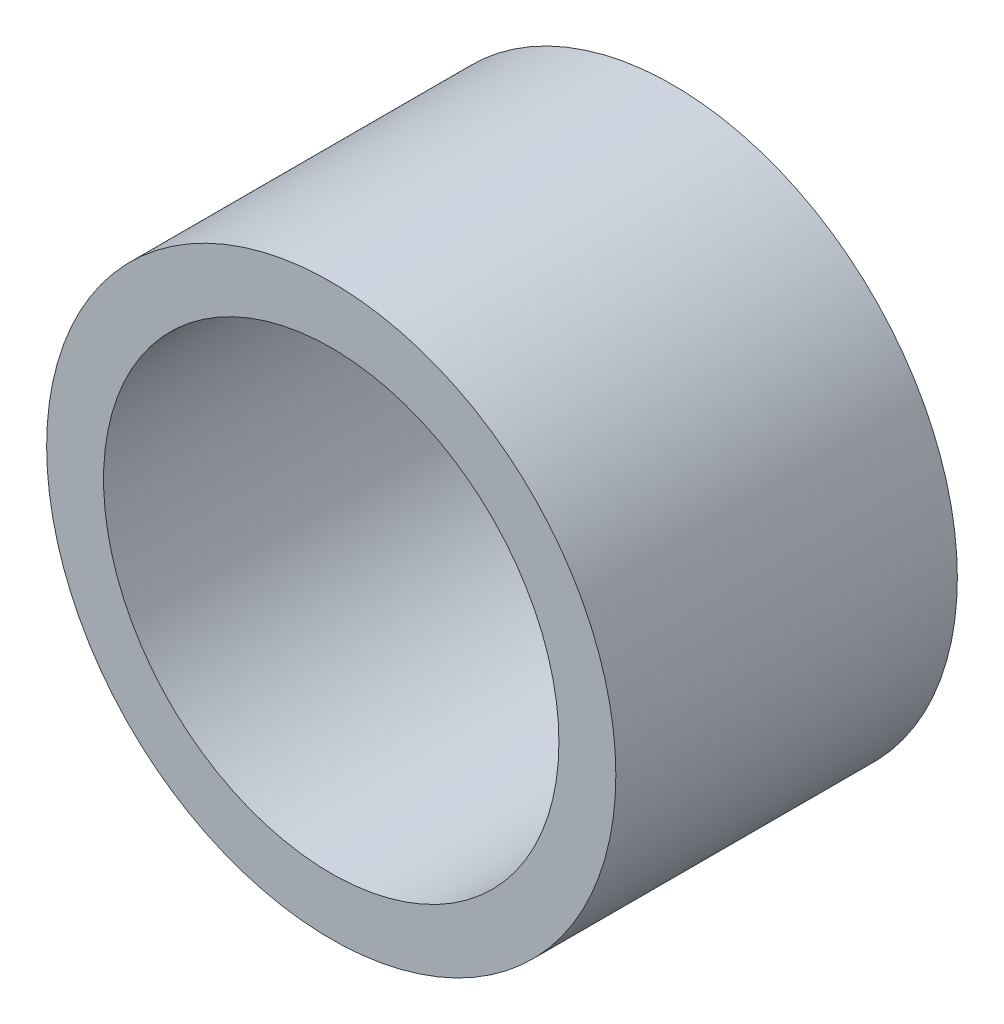
ISO-10303-21;
HEADER;
FILE_DESCRIPTION(('STEP AP214'),'2;1');
FILE_NAME('part.step','',(''),(''),'','','');
FILE_SCHEMA(('AUTOMOTIVE_DESIGN { 1 0 10303 214 1 1 1 1 }'));
ENDSEC;
DATA;
#1=APPLICATION_CONTEXT('core data for automotive mechanical design processes');
#2=APPLICATION_PROTOCOL_DEFINITION('international standard','automotive_design',2000,#1);
#3=PRODUCT_CONTEXT('',#1,'mechanical');
#4=PRODUCT('Part','Part','',(#3));
#5=PRODUCT_RELATED_PRODUCT_CATEGORY('part','',(#4));
#6=PRODUCT_DEFINITION_FORMATION('','',#4);
#7=PRODUCT_DEFINITION_CONTEXT('part definition',#1,'design');
#8=PRODUCT_DEFINITION('design','',#6,#7);
#9=PRODUCT_DEFINITION_SHAPE('','',#8);
#10=(LENGTH_UNIT() NAMED_UNIT(*) SI_UNIT(.MILLI.,.METRE.));
#11=(NAMED_UNIT(*) PLANE_ANGLE_UNIT() SI_UNIT($,.RADIAN.));
#12=(NAMED_UNIT(*) SI_UNIT($,.STERADIAN.) SOLID_ANGLE_UNIT());
#13=UNCERTAINTY_MEASURE_WITH_UNIT(LENGTH_MEASURE(1.E-05),#10,'distance_accuracy_value','');
#14=(GEOMETRIC_REPRESENTATION_CONTEXT(3) GLOBAL_UNCERTAINTY_ASSIGNED_CONTEXT((#13)) GLOBAL_UNIT_ASSIGNED_CONTEXT((#10,
#11,#12)) REPRESENTATION_CONTEXT('',''));
#15=CARTESIAN_POINT('',(0.,0.,0.));
#16=DIRECTION('',(0.,0.,1.));
#17=DIRECTION('',(1.,0.,0.));
#18=AXIS2_PLACEMENT_3D('',#15,#16,#17);
#19=CARTESIAN_POINT('',(0.,0.,4.7625));
#20=DIRECTION('',(0.,0.,1.));
#21=DIRECTION('',(1.,0.,0.));
#22=AXIS2_PLACEMENT_3D('',#19,#20,#21);
#23=PLANE('',#22);
#24=CARTESIAN_POINT('',(0.,0.,4.7625));
#25=DIRECTION('',(0.,0.,1.));
#26=DIRECTION('',(1.,0.,0.));
#27=AXIS2_PLACEMENT_3D('',#24,#25,#26);
#28=CIRCLE('',#27,7.9375);
#29=CARTESIAN_POINT('',(7.9375,0.,4.7625));
#30=VERTEX_POINT('',#29);
#31=EDGE_CURVE('E10',#30,#30,#28,.T.);
#32=ORIENTED_EDGE('',*,*,#31,.T.);
#33=EDGE_LOOP('',(#32));
#34=FACE_BOUND('',#33,.T.);
#35=CARTESIAN_POINT('',(0.,0.,4.7625));
#36=DIRECTION('',(0.,0.,1.));
#37=DIRECTION('',(1.,0.,0.));
#38=AXIS2_PLACEMENT_3D('',#35,#36,#37);
#39=CIRCLE('',#38,6.35);
#40=CARTESIAN_POINT('',(6.35,0.,4.7625));
#41=VERTEX_POINT('',#40);
#42=EDGE_CURVE('E41',#41,#41,#39,.T.);
#43=ORIENTED_EDGE('',*,*,#42,.F.);
#44=EDGE_LOOP('',(#43));
#45=FACE_BOUND('',#44,.T.);
#46=ADVANCED_FACE('F30',(#34,#45),#23,.T.);
#47=CARTESIAN_POINT('',(0.,0.,-4.7625));
#48=DIRECTION('',(0.,0.,1.));
#49=DIRECTION('',(1.,0.,0.));
#50=AXIS2_PLACEMENT_3D('',#47,#48,#49);
#51=PLANE('',#50);
#52=CARTESIAN_POINT('',(0.,0.,-4.7625));
#53=DIRECTION('',(0.,0.,1.));
#54=DIRECTION('',(1.,0.,0.));
#55=AXIS2_PLACEMENT_3D('',#52,#53,#54);
#56=CIRCLE('',#55,7.9375);
#57=CARTESIAN_POINT('',(7.9375,0.,-4.7625));
#58=VERTEX_POINT('',#57);
#59=EDGE_CURVE('E34',#58,#58,#56,.T.);
#60=ORIENTED_EDGE('',*,*,#59,.F.);
#61=EDGE_LOOP('',(#60));
#62=FACE_BOUND('',#61,.T.);
#63=CARTESIAN_POINT('',(0.,0.,-4.7625));
#64=DIRECTION('',(0.,0.,1.));
#65=DIRECTION('',(1.,0.,0.));
#66=AXIS2_PLACEMENT_3D('',#63,#64,#65);
#67=CIRCLE('',#66,6.35);
#68=CARTESIAN_POINT('',(6.35,0.,-4.7625));
#69=VERTEX_POINT('',#68);
#70=EDGE_CURVE('E43',#69,#69,#67,.T.);
#71=ORIENTED_EDGE('',*,*,#70,.T.);
#72=EDGE_LOOP('',(#71));
#73=FACE_BOUND('',#72,.T.);
#74=ADVANCED_FACE('F53',(#62,#73),#51,.F.);
#75=CARTESIAN_POINT('',(0.,0.,4.7625));
#76=DIRECTION('',(0.,0.,-1.));
#77=DIRECTION('',(-1.,0.,0.));
#78=AXIS2_PLACEMENT_3D('',#75,#76,#77);
#79=CYLINDRICAL_SURFACE('',#78,7.9375);
#80=ORIENTED_EDGE('',*,*,#31,.F.);
#81=EDGE_LOOP('',(#80));
#82=FACE_BOUND('',#81,.T.);
#83=ORIENTED_EDGE('',*,*,#59,.T.);
#84=EDGE_LOOP('',(#83));
#85=FACE_BOUND('',#84,.T.);
#86=ADVANCED_FACE('F32',(#82,#85),#79,.T.);
#87=CARTESIAN_POINT('',(0.,0.,4.7625));
#88=DIRECTION('',(0.,0.,-1.));
#89=DIRECTION('',(-1.,0.,0.));
#90=AXIS2_PLACEMENT_3D('',#87,#88,#89);
#91=CYLINDRICAL_SURFACE('',#90,6.35);
#92=ORIENTED_EDGE('',*,*,#42,.T.);
#93=EDGE_LOOP('',(#92));
#94=FACE_BOUND('',#93,.T.);
#95=ORIENTED_EDGE('',*,*,#70,.F.);
#96=EDGE_LOOP('',(#95));
#97=FACE_BOUND('',#96,.T.);
#98=ADVANCED_FACE('F49',(#94,#97),#91,.F.);
#99=CLOSED_SHELL('',(#46,#74,#86,#98));
#100=MANIFOLD_SOLID_BREP('B2',#99);
#101=ADVANCED_BREP_SHAPE_REPRESENTATION('',(#18,#100),#14);
#102=SHAPE_DEFINITION_REPRESENTATION(#9,#101);
ENDSEC;
END-ISO-10303-21;
